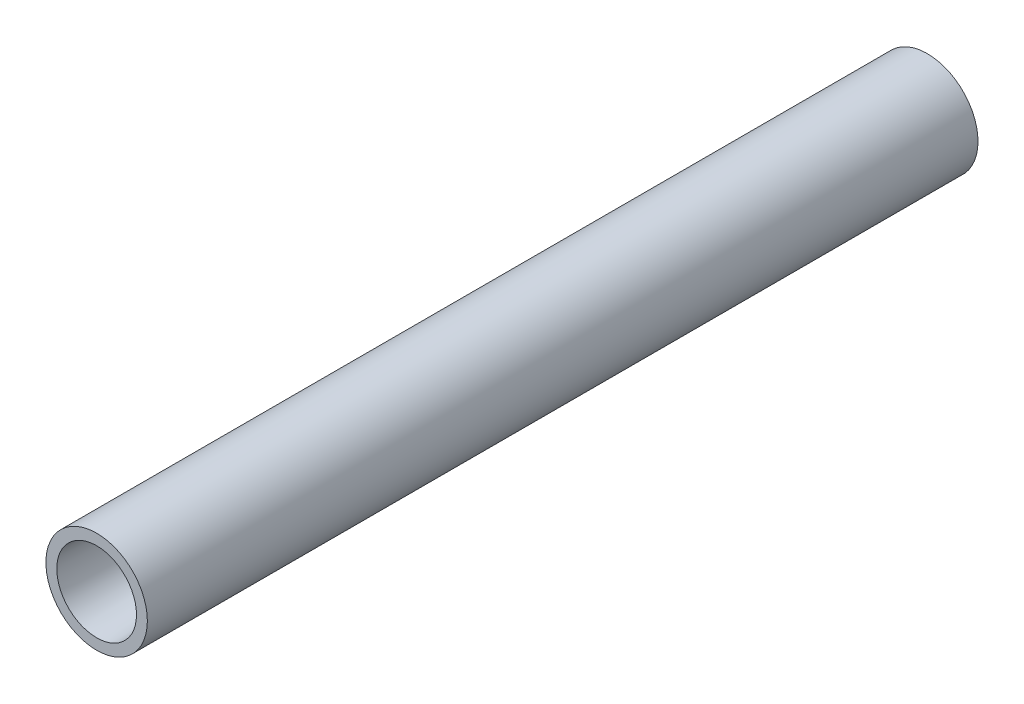
ISO-10303-21;
HEADER;
FILE_DESCRIPTION(('STEP AP214'),'2;1');
FILE_NAME('part.step','',(''),(''),'','','');
FILE_SCHEMA(('AUTOMOTIVE_DESIGN { 1 0 10303 214 1 1 1 1 }'));
ENDSEC;
DATA;
#1=APPLICATION_CONTEXT('core data for automotive mechanical design processes');
#2=APPLICATION_PROTOCOL_DEFINITION('international standard','automotive_design',2000,#1);
#3=PRODUCT_CONTEXT('',#1,'mechanical');
#4=PRODUCT('Part','Part','',(#3));
#5=PRODUCT_RELATED_PRODUCT_CATEGORY('part','',(#4));
#6=PRODUCT_DEFINITION_FORMATION('','',#4);
#7=PRODUCT_DEFINITION_CONTEXT('part definition',#1,'design');
#8=PRODUCT_DEFINITION('design','',#6,#7);
#9=PRODUCT_DEFINITION_SHAPE('','',#8);
#10=(LENGTH_UNIT() NAMED_UNIT(*) SI_UNIT(.MILLI.,.METRE.));
#11=(NAMED_UNIT(*) PLANE_ANGLE_UNIT() SI_UNIT($,.RADIAN.));
#12=(NAMED_UNIT(*) SI_UNIT($,.STERADIAN.) SOLID_ANGLE_UNIT());
#13=UNCERTAINTY_MEASURE_WITH_UNIT(LENGTH_MEASURE(1.E-05),#10,'distance_accuracy_value','');
#14=(GEOMETRIC_REPRESENTATION_CONTEXT(3) GLOBAL_UNCERTAINTY_ASSIGNED_CONTEXT((#13)) GLOBAL_UNIT_ASSIGNED_CONTEXT((#10,
#11,#12)) REPRESENTATION_CONTEXT('',''));
#15=CARTESIAN_POINT('',(0.,0.,0.));
#16=DIRECTION('',(0.,0.,1.));
#17=DIRECTION('',(1.,0.,0.));
#18=AXIS2_PLACEMENT_3D('',#15,#16,#17);
#19=CARTESIAN_POINT('',(0.,0.,65.5));
#20=DIRECTION('',(0.,0.,-1.));
#21=DIRECTION('',(-1.,0.,0.));
#22=AXIS2_PLACEMENT_3D('',#19,#20,#21);
#23=CYLINDRICAL_SURFACE('',#22,1.);
#24=CARTESIAN_POINT('',(0.,0.,9.0297));
#25=DIRECTION('',(0.,0.,1.));
#26=DIRECTION('',(1.,0.,0.));
#27=AXIS2_PLACEMENT_3D('',#24,#25,#26);
#28=CIRCLE('',#27,1.);
#29=CARTESIAN_POINT('',(1.,0.,9.0297));
#30=VERTEX_POINT('',#29);
#31=EDGE_CURVE('E52',#30,#30,#28,.T.);
#32=ORIENTED_EDGE('',*,*,#31,.F.);
#33=EDGE_LOOP('',(#32));
#34=FACE_BOUND('',#33,.T.);
#35=CARTESIAN_POINT('',(0.,0.,56.4703));
#36=DIRECTION('',(0.,0.,1.));
#37=DIRECTION('',(1.,0.,0.));
#38=AXIS2_PLACEMENT_3D('',#35,#36,#37);
#39=CIRCLE('',#38,1.);
#40=CARTESIAN_POINT('',(1.,0.,56.4703));
#41=VERTEX_POINT('',#40);
#42=EDGE_CURVE('E41',#41,#41,#39,.T.);
#43=ORIENTED_EDGE('',*,*,#42,.T.);
#44=EDGE_LOOP('',(#43));
#45=FACE_BOUND('',#44,.T.);
#46=ADVANCED_FACE('F37',(#34,#45),#23,.F.);
#47=CARTESIAN_POINT('',(0.,0.,65.5));
#48=DIRECTION('',(0.,0.,-1.));
#49=DIRECTION('',(-1.,0.,0.));
#50=AXIS2_PLACEMENT_3D('',#47,#48,#49);
#51=CYLINDRICAL_SURFACE('',#50,4.);
#52=CARTESIAN_POINT('',(0.,0.,65.5));
#53=DIRECTION('',(0.,0.,1.));
#54=DIRECTION('',(1.,0.,0.));
#55=AXIS2_PLACEMENT_3D('',#52,#53,#54);
#56=CIRCLE('',#55,4.);
#57=CARTESIAN_POINT('',(4.,0.,65.5));
#58=VERTEX_POINT('',#57);
#59=EDGE_CURVE('E10',#58,#58,#56,.T.);
#60=ORIENTED_EDGE('',*,*,#59,.F.);
#61=EDGE_LOOP('',(#60));
#62=FACE_BOUND('',#61,.T.);
#63=CARTESIAN_POINT('',(0.,0.,0.));
#64=DIRECTION('',(0.,0.,1.));
#65=DIRECTION('',(1.,0.,0.));
#66=AXIS2_PLACEMENT_3D('',#63,#64,#65);
#67=CIRCLE('',#66,4.);
#68=CARTESIAN_POINT('',(4.,0.,0.));
#69=VERTEX_POINT('',#68);
#70=EDGE_CURVE('E46',#69,#69,#67,.T.);
#71=ORIENTED_EDGE('',*,*,#70,.T.);
#72=EDGE_LOOP('',(#71));
#73=FACE_BOUND('',#72,.T.);
#74=ADVANCED_FACE('F39',(#62,#73),#51,.T.);
#75=CARTESIAN_POINT('',(0.,0.,65.5));
#76=DIRECTION('',(0.,0.,1.));
#77=DIRECTION('',(1.,0.,0.));
#78=AXIS2_PLACEMENT_3D('',#75,#76,#77);
#79=PLANE('',#78);
#80=CARTESIAN_POINT('',(0.,0.,65.5));
#81=DIRECTION('',(0.,0.,1.));
#82=DIRECTION('',(1.,0.,0.));
#83=AXIS2_PLACEMENT_3D('',#80,#81,#82);
#84=CIRCLE('',#83,3.14325);
#85=CARTESIAN_POINT('',(3.14325,0.,65.5));
#86=VERTEX_POINT('',#85);
#87=EDGE_CURVE('E77',#86,#86,#84,.T.);
#88=ORIENTED_EDGE('',*,*,#87,.F.);
#89=EDGE_LOOP('',(#88));
#90=FACE_BOUND('',#89,.T.);
#91=ORIENTED_EDGE('',*,*,#59,.T.);
#92=EDGE_LOOP('',(#91));
#93=FACE_BOUND('',#92,.T.);
#94=ADVANCED_FACE('F84',(#90,#93),#79,.T.);
#95=CARTESIAN_POINT('',(0.,0.,0.));
#96=DIRECTION('',(0.,0.,1.));
#97=DIRECTION('',(1.,0.,0.));
#98=AXIS2_PLACEMENT_3D('',#95,#96,#97);
#99=PLANE('',#98);
#100=CARTESIAN_POINT('',(0.,0.,0.));
#101=DIRECTION('',(0.,0.,1.));
#102=DIRECTION('',(1.,0.,0.));
#103=AXIS2_PLACEMENT_3D('',#100,#101,#102);
#104=CIRCLE('',#103,3.14325);
#105=CARTESIAN_POINT('',(3.14325,0.,0.));
#106=VERTEX_POINT('',#105);
#107=EDGE_CURVE('E63',#106,#106,#104,.T.);
#108=ORIENTED_EDGE('',*,*,#107,.T.);
#109=EDGE_LOOP('',(#108));
#110=FACE_BOUND('',#109,.T.);
#111=ORIENTED_EDGE('',*,*,#70,.F.);
#112=EDGE_LOOP('',(#111));
#113=FACE_BOUND('',#112,.T.);
#114=ADVANCED_FACE('F86',(#110,#113),#99,.F.);
#115=CARTESIAN_POINT('',(0.,0.,0.));
#116=DIRECTION('',(0.,0.,-1.));
#117=DIRECTION('',(1.,0.,0.));
#118=AXIS2_PLACEMENT_3D('',#115,#116,#117);
#119=CONICAL_SURFACE('',#118,3.14325,0.0406312649864281);
#120=CARTESIAN_POINT('',(0.,0.,9.0297));
#121=DIRECTION('',(0.,0.,1.));
#122=DIRECTION('',(1.,0.,0.));
#123=AXIS2_PLACEMENT_3D('',#120,#121,#122);
#124=CIRCLE('',#123,2.77615983463477);
#125=CARTESIAN_POINT('',(2.77615983463477,0.,9.0297));
#126=VERTEX_POINT('',#125);
#127=EDGE_CURVE('E55',#126,#126,#124,.T.);
#128=ORIENTED_EDGE('',*,*,#127,.T.);
#129=EDGE_LOOP('',(#128));
#130=FACE_BOUND('',#129,.T.);
#131=ORIENTED_EDGE('',*,*,#107,.F.);
#132=EDGE_LOOP('',(#131));
#133=FACE_BOUND('',#132,.T.);
#134=ADVANCED_FACE('F92',(#130,#133),#119,.F.);
#135=CARTESIAN_POINT('',(0.,0.,9.0297));
#136=DIRECTION('',(0.,0.,1.));
#137=DIRECTION('',(1.,0.,0.));
#138=AXIS2_PLACEMENT_3D('',#135,#136,#137);
#139=PLANE('',#138);
#140=ORIENTED_EDGE('',*,*,#31,.T.);
#141=EDGE_LOOP('',(#140));
#142=FACE_BOUND('',#141,.T.);
#143=ORIENTED_EDGE('',*,*,#127,.F.);
#144=EDGE_LOOP('',(#143));
#145=FACE_BOUND('',#144,.T.);
#146=ADVANCED_FACE('F103',(#142,#145),#139,.F.);
#147=CARTESIAN_POINT('',(0.,0.,65.5));
#148=DIRECTION('',(0.,0.,1.));
#149=DIRECTION('',(1.,0.,0.));
#150=AXIS2_PLACEMENT_3D('',#147,#148,#149);
#151=CONICAL_SURFACE('',#150,3.14325,0.0406312649864281);
#152=CARTESIAN_POINT('',(0.,0.,56.4703));
#153=DIRECTION('',(0.,0.,1.));
#154=DIRECTION('',(1.,0.,0.));
#155=AXIS2_PLACEMENT_3D('',#152,#153,#154);
#156=CIRCLE('',#155,2.77615983463477);
#157=CARTESIAN_POINT('',(2.77615983463477,0.,56.4703));
#158=VERTEX_POINT('',#157);
#159=EDGE_CURVE('E72',#158,#158,#156,.T.);
#160=ORIENTED_EDGE('',*,*,#159,.F.);
#161=EDGE_LOOP('',(#160));
#162=FACE_BOUND('',#161,.T.);
#163=ORIENTED_EDGE('',*,*,#87,.T.);
#164=EDGE_LOOP('',(#163));
#165=FACE_BOUND('',#164,.T.);
#166=ADVANCED_FACE('F82',(#162,#165),#151,.F.);
#167=CARTESIAN_POINT('',(0.,0.,56.4703));
#168=DIRECTION('',(0.,0.,1.));
#169=DIRECTION('',(1.,0.,0.));
#170=AXIS2_PLACEMENT_3D('',#167,#168,#169);
#171=PLANE('',#170);
#172=ORIENTED_EDGE('',*,*,#42,.F.);
#173=EDGE_LOOP('',(#172));
#174=FACE_BOUND('',#173,.T.);
#175=ORIENTED_EDGE('',*,*,#159,.T.);
#176=EDGE_LOOP('',(#175));
#177=FACE_BOUND('',#176,.T.);
#178=ADVANCED_FACE('F108',(#174,#177),#171,.T.);
#179=CLOSED_SHELL('',(#46,#74,#94,#114,#134,#146,#166,#178));
#180=MANIFOLD_SOLID_BREP('B2',#179);
#181=ADVANCED_BREP_SHAPE_REPRESENTATION('',(#18,#180),#14);
#182=SHAPE_DEFINITION_REPRESENTATION(#9,#181);
ENDSEC;
END-ISO-10303-21;
